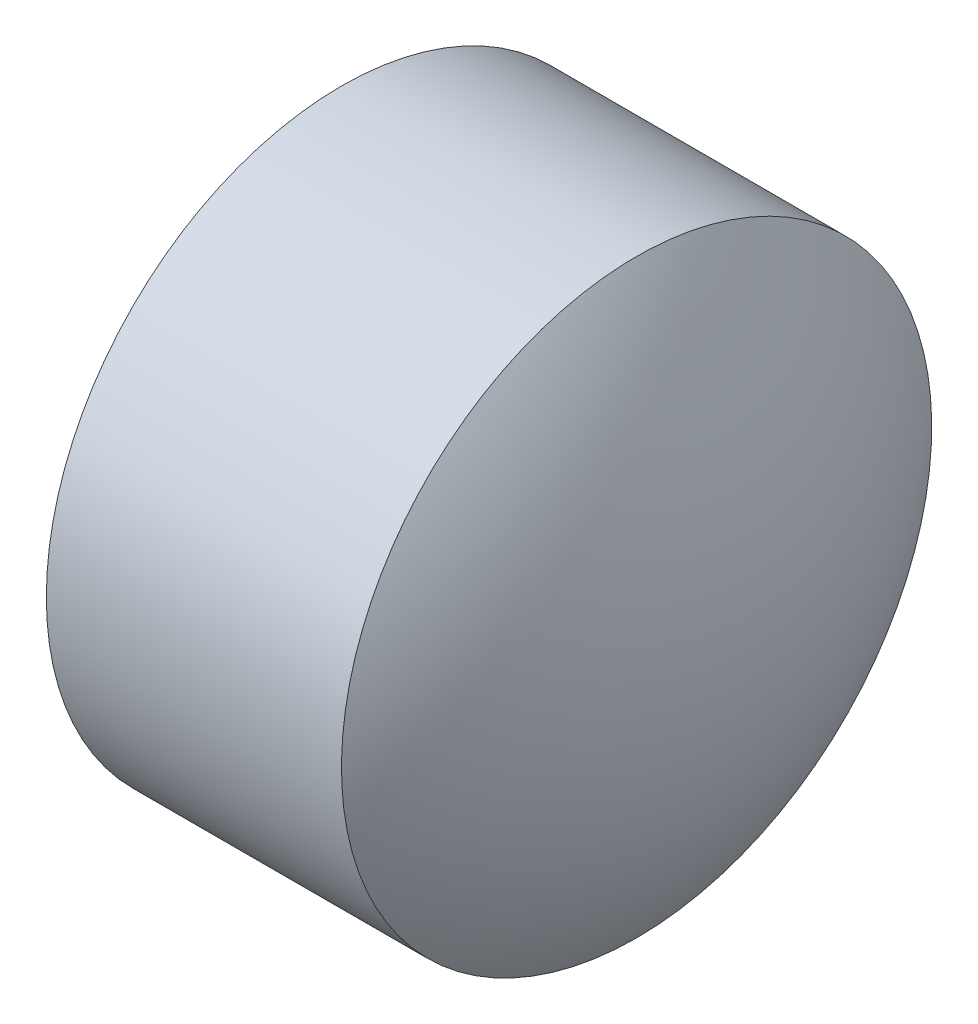
ISO-10303-21;
HEADER;
FILE_DESCRIPTION(('STEP AP214'),'2;1');
FILE_NAME('part.step','',(''),(''),'','','');
FILE_SCHEMA(('AUTOMOTIVE_DESIGN { 1 0 10303 214 1 1 1 1 }'));
ENDSEC;
DATA;
#1=APPLICATION_CONTEXT('core data for automotive mechanical design processes');
#2=APPLICATION_PROTOCOL_DEFINITION('international standard','automotive_design',2000,#1);
#3=PRODUCT_CONTEXT('',#1,'mechanical');
#4=PRODUCT('Part','Part','',(#3));
#5=PRODUCT_RELATED_PRODUCT_CATEGORY('part','',(#4));
#6=PRODUCT_DEFINITION_FORMATION('','',#4);
#7=PRODUCT_DEFINITION_CONTEXT('part definition',#1,'design');
#8=PRODUCT_DEFINITION('design','',#6,#7);
#9=PRODUCT_DEFINITION_SHAPE('','',#8);
#10=(LENGTH_UNIT() NAMED_UNIT(*) SI_UNIT(.MILLI.,.METRE.));
#11=(NAMED_UNIT(*) PLANE_ANGLE_UNIT() SI_UNIT($,.RADIAN.));
#12=(NAMED_UNIT(*) SI_UNIT($,.STERADIAN.) SOLID_ANGLE_UNIT());
#13=UNCERTAINTY_MEASURE_WITH_UNIT(LENGTH_MEASURE(1.E-05),#10,'distance_accuracy_value','');
#14=(GEOMETRIC_REPRESENTATION_CONTEXT(3) GLOBAL_UNCERTAINTY_ASSIGNED_CONTEXT((#13)) GLOBAL_UNIT_ASSIGNED_CONTEXT((#10,
#11,#12)) REPRESENTATION_CONTEXT('',''));
#15=CARTESIAN_POINT('',(0.,0.,0.));
#16=DIRECTION('',(0.,0.,1.));
#17=DIRECTION('',(1.,0.,0.));
#18=AXIS2_PLACEMENT_3D('',#15,#16,#17);
#19=CARTESIAN_POINT('',(7.73753338058264,3.82804039552678,0.));
#20=DIRECTION('',(-1.,0.,0.));
#21=DIRECTION('',(0.,1.,0.));
#22=AXIS2_PLACEMENT_3D('',#19,#20,#21);
#23=SPHERICAL_SURFACE('',#22,1.74480158730151);
#24=CARTESIAN_POINT('',(6.30773179328124,3.82804039552677,0.));
#25=DIRECTION('',(-1.,0.,0.));
#26=DIRECTION('',(0.,-1.,0.));
#27=AXIS2_PLACEMENT_3D('',#24,#25,#26);
#28=CIRCLE('',#27,1.0000000000001);
#29=CARTESIAN_POINT('',(6.30773179328125,2.82804039552667,0.));
#30=VERTEX_POINT('',#29);
#31=EDGE_CURVE('E46',#30,#30,#28,.T.);
#32=ORIENTED_EDGE('',*,*,#31,.T.);
#33=EDGE_LOOP('',(#32));
#34=FACE_BOUND('',#33,.T.);
#35=ADVANCED_FACE('F39',(#34),#23,.T.);
#36=CARTESIAN_POINT('',(5.87793020597985,3.82804039552676,0.));
#37=DIRECTION('',(-1.,0.,0.));
#38=DIRECTION('',(0.,-1.,0.));
#39=AXIS2_PLACEMENT_3D('',#36,#37,#38);
#40=SPHERICAL_SURFACE('',#39,1.74480158730148);
#41=CARTESIAN_POINT('',(7.30773179328124,3.82804039552678,0.));
#42=DIRECTION('',(-1.,0.,0.));
#43=DIRECTION('',(0.,-1.,0.));
#44=AXIS2_PLACEMENT_3D('',#41,#42,#43);
#45=CIRCLE('',#44,1.00000000000009);
#46=CARTESIAN_POINT('',(7.30773179328125,2.82804039552669,0.));
#47=VERTEX_POINT('',#46);
#48=EDGE_CURVE('E10',#47,#47,#45,.T.);
#49=ORIENTED_EDGE('',*,*,#48,.F.);
#50=EDGE_LOOP('',(#49));
#51=FACE_BOUND('',#50,.T.);
#52=ADVANCED_FACE('F56',(#51),#40,.T.);
#53=CARTESIAN_POINT('',(5.87793020597985,3.82804039552676,0.));
#54=DIRECTION('',(-1.,0.,0.));
#55=DIRECTION('',(0.,-1.,0.));
#56=AXIS2_PLACEMENT_3D('',#53,#54,#55);
#57=CYLINDRICAL_SURFACE('',#56,1.00000000000009);
#58=ORIENTED_EDGE('',*,*,#48,.T.);
#59=EDGE_LOOP('',(#58));
#60=FACE_BOUND('',#59,.T.);
#61=ORIENTED_EDGE('',*,*,#31,.F.);
#62=EDGE_LOOP('',(#61));
#63=FACE_BOUND('',#62,.T.);
#64=ADVANCED_FACE('F54',(#60,#63),#57,.T.);
#65=CLOSED_SHELL('',(#35,#52,#64));
#66=MANIFOLD_SOLID_BREP('B2',#65);
#67=ADVANCED_BREP_SHAPE_REPRESENTATION('',(#18,#66),#14);
#68=SHAPE_DEFINITION_REPRESENTATION(#9,#67);
ENDSEC;
END-ISO-10303-21;
